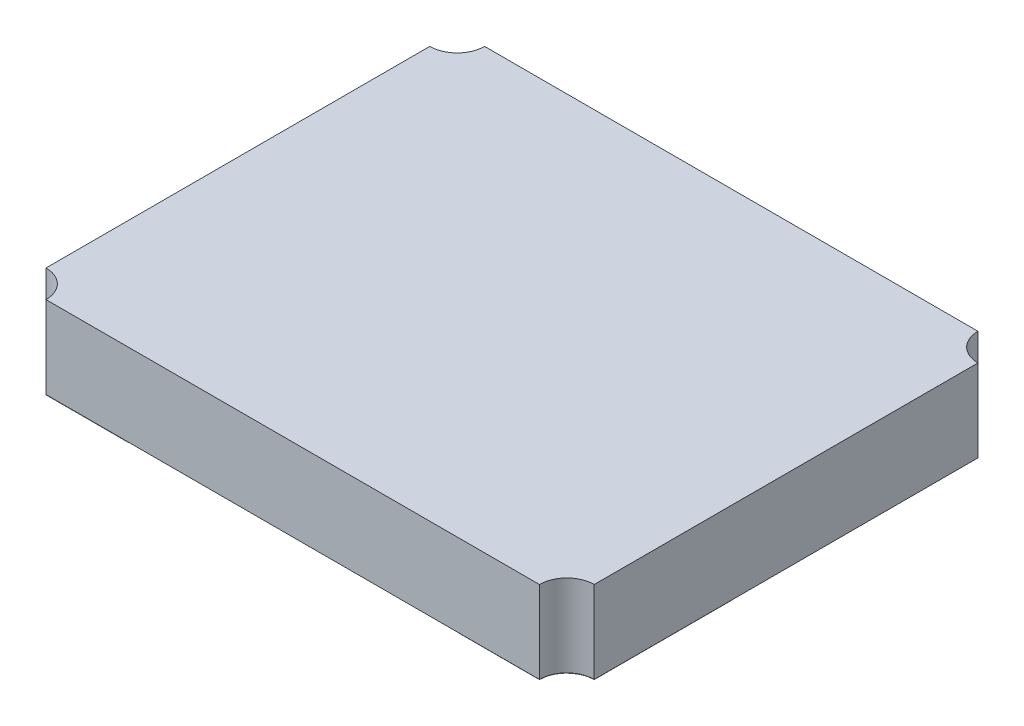
ISO-10303-21;
HEADER;
FILE_DESCRIPTION(('STEP AP214'),'2;1');
FILE_NAME('part.step','',(''),(''),'','','');
FILE_SCHEMA(('AUTOMOTIVE_DESIGN { 1 0 10303 214 1 1 1 1 }'));
ENDSEC;
DATA;
#1=APPLICATION_CONTEXT('core data for automotive mechanical design processes');
#2=APPLICATION_PROTOCOL_DEFINITION('international standard','automotive_design',2000,#1);
#3=PRODUCT_CONTEXT('',#1,'mechanical');
#4=PRODUCT('Part','Part','',(#3));
#5=PRODUCT_RELATED_PRODUCT_CATEGORY('part','',(#4));
#6=PRODUCT_DEFINITION_FORMATION('','',#4);
#7=PRODUCT_DEFINITION_CONTEXT('part definition',#1,'design');
#8=PRODUCT_DEFINITION('design','',#6,#7);
#9=PRODUCT_DEFINITION_SHAPE('','',#8);
#10=(LENGTH_UNIT() NAMED_UNIT(*) SI_UNIT(.MILLI.,.METRE.));
#11=(NAMED_UNIT(*) PLANE_ANGLE_UNIT() SI_UNIT($,.RADIAN.));
#12=(NAMED_UNIT(*) SI_UNIT($,.STERADIAN.) SOLID_ANGLE_UNIT());
#13=UNCERTAINTY_MEASURE_WITH_UNIT(LENGTH_MEASURE(1.E-05),#10,'distance_accuracy_value','');
#14=(GEOMETRIC_REPRESENTATION_CONTEXT(3) GLOBAL_UNCERTAINTY_ASSIGNED_CONTEXT((#13)) GLOBAL_UNIT_ASSIGNED_CONTEXT((#10,
#11,#12)) REPRESENTATION_CONTEXT('',''));
#15=CARTESIAN_POINT('',(0.,0.,0.));
#16=DIRECTION('',(0.,0.,1.));
#17=DIRECTION('',(1.,0.,0.));
#18=AXIS2_PLACEMENT_3D('',#15,#16,#17);
#19=CARTESIAN_POINT('',(0.,0.,0.));
#20=DIRECTION('',(0.,-1.,0.));
#21=DIRECTION('',(0.,0.,-1.));
#22=AXIS2_PLACEMENT_3D('',#19,#20,#21);
#23=PLANE('',#22);
#24=DIRECTION('',(0.,0.,1.));
#25=VECTOR('',#24,1.);
#26=CARTESIAN_POINT('',(-1.,0.,0.7));
#27=LINE('',#26,#25);
#28=CARTESIAN_POINT('',(-1.,0.,-0.7));
#29=VERTEX_POINT('',#28);
#30=CARTESIAN_POINT('',(-1.,0.,0.7));
#31=VERTEX_POINT('',#30);
#32=EDGE_CURVE('P0_E109',#29,#31,#27,.T.);
#33=ORIENTED_EDGE('',*,*,#32,.F.);
#34=CARTESIAN_POINT('',(-1.,0.,-0.8));
#35=DIRECTION('',(0.,-1.,0.));
#36=DIRECTION('',(0.,0.,-1.));
#37=AXIS2_PLACEMENT_3D('',#34,#35,#36);
#38=CIRCLE('',#37,0.1);
#39=CARTESIAN_POINT('',(-0.9,0.,-0.8));
#40=VERTEX_POINT('',#39);
#41=EDGE_CURVE('P0_E88',#29,#40,#38,.F.);
#42=ORIENTED_EDGE('',*,*,#41,.T.);
#43=DIRECTION('',(-1.,0.,0.));
#44=VECTOR('',#43,1.);
#45=CARTESIAN_POINT('',(-0.9,0.,-0.8));
#46=LINE('',#45,#44);
#47=CARTESIAN_POINT('',(0.9,0.,-0.8));
#48=VERTEX_POINT('',#47);
#49=EDGE_CURVE('P0_E86',#48,#40,#46,.T.);
#50=ORIENTED_EDGE('',*,*,#49,.F.);
#51=CARTESIAN_POINT('',(1.,0.,-0.8));
#52=DIRECTION('',(0.,-1.,0.));
#53=DIRECTION('',(0.,0.,-1.));
#54=AXIS2_PLACEMENT_3D('',#51,#52,#53);
#55=CIRCLE('',#54,0.1);
#56=CARTESIAN_POINT('',(1.,0.,-0.7));
#57=VERTEX_POINT('',#56);
#58=EDGE_CURVE('P0_E19',#48,#57,#55,.F.);
#59=ORIENTED_EDGE('',*,*,#58,.T.);
#60=DIRECTION('',(0.,0.,-1.));
#61=VECTOR('',#60,1.);
#62=CARTESIAN_POINT('',(1.,0.,0.));
#63=LINE('',#62,#61);
#64=CARTESIAN_POINT('',(1.,0.,0.7));
#65=VERTEX_POINT('',#64);
#66=EDGE_CURVE('P0_E84',#57,#65,#63,.F.);
#67=ORIENTED_EDGE('',*,*,#66,.T.);
#68=CARTESIAN_POINT('',(1.,0.,0.8));
#69=DIRECTION('',(0.,-1.,0.));
#70=DIRECTION('',(0.,0.,-1.));
#71=AXIS2_PLACEMENT_3D('',#68,#69,#70);
#72=CIRCLE('',#71,0.1);
#73=CARTESIAN_POINT('',(0.9,0.,0.8));
#74=VERTEX_POINT('',#73);
#75=EDGE_CURVE('P0_E118',#65,#74,#72,.F.);
#76=ORIENTED_EDGE('',*,*,#75,.T.);
#77=DIRECTION('',(1.,0.,0.));
#78=VECTOR('',#77,1.);
#79=CARTESIAN_POINT('',(0.9,0.,0.8));
#80=LINE('',#79,#78);
#81=CARTESIAN_POINT('',(-0.9,0.,0.8));
#82=VERTEX_POINT('',#81);
#83=EDGE_CURVE('P0_E115',#82,#74,#80,.T.);
#84=ORIENTED_EDGE('',*,*,#83,.F.);
#85=CARTESIAN_POINT('',(-1.,0.,0.8));
#86=DIRECTION('',(0.,-1.,0.));
#87=DIRECTION('',(0.,0.,-1.));
#88=AXIS2_PLACEMENT_3D('',#85,#86,#87);
#89=CIRCLE('',#88,0.1);
#90=EDGE_CURVE('P0_E113',#82,#31,#89,.F.);
#91=ORIENTED_EDGE('',*,*,#90,.T.);
#92=EDGE_LOOP('',(#33,#42,#50,#59,#67,#76,#84,#91));
#93=FACE_BOUND('',#92,.T.);
#94=ADVANCED_FACE('P0_F16',(#93),#23,.T.);
#95=CARTESIAN_POINT('',(1.,0.3,0.8));
#96=DIRECTION('',(0.,-1.,0.));
#97=DIRECTION('',(0.,0.,-1.));
#98=AXIS2_PLACEMENT_3D('',#95,#96,#97);
#99=CYLINDRICAL_SURFACE('',#98,0.1);
#100=DIRECTION('',(0.,1.,0.));
#101=VECTOR('',#100,1.);
#102=CARTESIAN_POINT('',(1.,0.3,0.7));
#103=LINE('',#102,#101);
#104=CARTESIAN_POINT('',(1.,0.3,0.7));
#105=VERTEX_POINT('',#104);
#106=EDGE_CURVE('P0_E97',#105,#65,#103,.F.);
#107=ORIENTED_EDGE('',*,*,#106,.F.);
#108=CARTESIAN_POINT('',(1.,0.3,0.8));
#109=DIRECTION('',(0.,-1.,0.));
#110=DIRECTION('',(0.,0.,-1.));
#111=AXIS2_PLACEMENT_3D('',#108,#109,#110);
#112=CIRCLE('',#111,0.1);
#113=CARTESIAN_POINT('',(0.9,0.3,0.8));
#114=VERTEX_POINT('',#113);
#115=EDGE_CURVE('P0_E130',#105,#114,#112,.F.);
#116=ORIENTED_EDGE('',*,*,#115,.T.);
#117=DIRECTION('',(0.,1.,0.));
#118=VECTOR('',#117,1.);
#119=CARTESIAN_POINT('',(0.9,0.3,0.8));
#120=LINE('',#119,#118);
#121=EDGE_CURVE('P0_E114',#74,#114,#120,.T.);
#122=ORIENTED_EDGE('',*,*,#121,.F.);
#123=ORIENTED_EDGE('',*,*,#75,.F.);
#124=EDGE_LOOP('',(#107,#116,#122,#123));
#125=FACE_BOUND('',#124,.T.);
#126=ADVANCED_FACE('P0_F141',(#125),#99,.F.);
#127=CARTESIAN_POINT('',(0.9,0.3,0.8));
#128=DIRECTION('',(0.,0.,1.));
#129=DIRECTION('',(1.,0.,0.));
#130=AXIS2_PLACEMENT_3D('',#127,#128,#129);
#131=PLANE('',#130);
#132=ORIENTED_EDGE('',*,*,#83,.T.);
#133=ORIENTED_EDGE('',*,*,#121,.T.);
#134=DIRECTION('',(1.,0.,0.));
#135=VECTOR('',#134,1.);
#136=CARTESIAN_POINT('',(0.,0.3,0.8));
#137=LINE('',#136,#135);
#138=CARTESIAN_POINT('',(-0.9,0.3,0.8));
#139=VERTEX_POINT('',#138);
#140=EDGE_CURVE('P0_E129',#114,#139,#137,.F.);
#141=ORIENTED_EDGE('',*,*,#140,.T.);
#142=DIRECTION('',(0.,-1.,0.));
#143=VECTOR('',#142,1.);
#144=CARTESIAN_POINT('',(-0.9,0.3,0.8));
#145=LINE('',#144,#143);
#146=EDGE_CURVE('P0_E110',#139,#82,#145,.T.);
#147=ORIENTED_EDGE('',*,*,#146,.T.);
#148=EDGE_LOOP('',(#132,#133,#141,#147));
#149=FACE_BOUND('',#148,.T.);
#150=ADVANCED_FACE('P0_F145',(#149),#131,.T.);
#151=CARTESIAN_POINT('',(-1.,0.3,0.8));
#152=DIRECTION('',(0.,-1.,0.));
#153=DIRECTION('',(0.,0.,-1.));
#154=AXIS2_PLACEMENT_3D('',#151,#152,#153);
#155=CYLINDRICAL_SURFACE('',#154,0.1);
#156=ORIENTED_EDGE('',*,*,#146,.F.);
#157=CARTESIAN_POINT('',(-1.,0.3,0.8));
#158=DIRECTION('',(0.,-1.,0.));
#159=DIRECTION('',(0.,0.,-1.));
#160=AXIS2_PLACEMENT_3D('',#157,#158,#159);
#161=CIRCLE('',#160,0.1);
#162=CARTESIAN_POINT('',(-1.,0.3,0.7));
#163=VERTEX_POINT('',#162);
#164=EDGE_CURVE('P0_E126',#139,#163,#161,.F.);
#165=ORIENTED_EDGE('',*,*,#164,.T.);
#166=DIRECTION('',(0.,1.,0.));
#167=VECTOR('',#166,1.);
#168=CARTESIAN_POINT('',(-1.,0.3,0.7));
#169=LINE('',#168,#167);
#170=EDGE_CURVE('P0_E107',#31,#163,#169,.T.);
#171=ORIENTED_EDGE('',*,*,#170,.F.);
#172=ORIENTED_EDGE('',*,*,#90,.F.);
#173=EDGE_LOOP('',(#156,#165,#171,#172));
#174=FACE_BOUND('',#173,.T.);
#175=ADVANCED_FACE('P0_F159',(#174),#155,.F.);
#176=CARTESIAN_POINT('',(-1.,0.3,0.7));
#177=DIRECTION('',(-1.,0.,0.));
#178=DIRECTION('',(0.,0.,1.));
#179=AXIS2_PLACEMENT_3D('',#176,#177,#178);
#180=PLANE('',#179);
#181=ORIENTED_EDGE('',*,*,#32,.T.);
#182=ORIENTED_EDGE('',*,*,#170,.T.);
#183=DIRECTION('',(0.,0.,-1.));
#184=VECTOR('',#183,1.);
#185=CARTESIAN_POINT('',(-1.,0.3,0.));
#186=LINE('',#185,#184);
#187=CARTESIAN_POINT('',(-1.,0.3,-0.7));
#188=VERTEX_POINT('',#187);
#189=EDGE_CURVE('P0_E125',#163,#188,#186,.T.);
#190=ORIENTED_EDGE('',*,*,#189,.T.);
#191=DIRECTION('',(0.,-1.,0.));
#192=VECTOR('',#191,1.);
#193=CARTESIAN_POINT('',(-1.,0.3,-0.7));
#194=LINE('',#193,#192);
#195=EDGE_CURVE('P0_E104',#188,#29,#194,.T.);
#196=ORIENTED_EDGE('',*,*,#195,.T.);
#197=EDGE_LOOP('',(#181,#182,#190,#196));
#198=FACE_BOUND('',#197,.T.);
#199=ADVANCED_FACE('P0_F155',(#198),#180,.T.);
#200=CARTESIAN_POINT('',(-1.,0.3,-0.8));
#201=DIRECTION('',(0.,-1.,0.));
#202=DIRECTION('',(0.,0.,-1.));
#203=AXIS2_PLACEMENT_3D('',#200,#201,#202);
#204=CYLINDRICAL_SURFACE('',#203,0.1);
#205=ORIENTED_EDGE('',*,*,#195,.F.);
#206=CARTESIAN_POINT('',(-1.,0.3,-0.8));
#207=DIRECTION('',(0.,-1.,0.));
#208=DIRECTION('',(0.,0.,-1.));
#209=AXIS2_PLACEMENT_3D('',#206,#207,#208);
#210=CIRCLE('',#209,0.1);
#211=CARTESIAN_POINT('',(-0.9,0.3,-0.8));
#212=VERTEX_POINT('',#211);
#213=EDGE_CURVE('P0_E122',#188,#212,#210,.F.);
#214=ORIENTED_EDGE('',*,*,#213,.T.);
#215=DIRECTION('',(0.,1.,0.));
#216=VECTOR('',#215,1.);
#217=CARTESIAN_POINT('',(-0.9,0.3,-0.8));
#218=LINE('',#217,#216);
#219=EDGE_CURVE('P0_E91',#40,#212,#218,.T.);
#220=ORIENTED_EDGE('',*,*,#219,.F.);
#221=ORIENTED_EDGE('',*,*,#41,.F.);
#222=EDGE_LOOP('',(#205,#214,#220,#221));
#223=FACE_BOUND('',#222,.T.);
#224=ADVANCED_FACE('P0_F161',(#223),#204,.F.);
#225=CARTESIAN_POINT('',(-0.9,0.3,-0.8));
#226=DIRECTION('',(0.,0.,-1.));
#227=DIRECTION('',(-1.,0.,0.));
#228=AXIS2_PLACEMENT_3D('',#225,#226,#227);
#229=PLANE('',#228);
#230=ORIENTED_EDGE('',*,*,#49,.T.);
#231=ORIENTED_EDGE('',*,*,#219,.T.);
#232=DIRECTION('',(1.,0.,0.));
#233=VECTOR('',#232,1.);
#234=CARTESIAN_POINT('',(0.,0.3,-0.8));
#235=LINE('',#234,#233);
#236=CARTESIAN_POINT('',(0.9,0.3,-0.8));
#237=VERTEX_POINT('',#236);
#238=EDGE_CURVE('P0_E96',#212,#237,#235,.T.);
#239=ORIENTED_EDGE('',*,*,#238,.T.);
#240=DIRECTION('',(0.,-1.,0.));
#241=VECTOR('',#240,1.);
#242=CARTESIAN_POINT('',(0.9,0.3,-0.8));
#243=LINE('',#242,#241);
#244=EDGE_CURVE('P0_E81',#237,#48,#243,.T.);
#245=ORIENTED_EDGE('',*,*,#244,.T.);
#246=EDGE_LOOP('',(#230,#231,#239,#245));
#247=FACE_BOUND('',#246,.T.);
#248=ADVANCED_FACE('P0_F94',(#247),#229,.T.);
#249=CARTESIAN_POINT('',(1.,0.3,-0.8));
#250=DIRECTION('',(0.,-1.,0.));
#251=DIRECTION('',(0.,0.,-1.));
#252=AXIS2_PLACEMENT_3D('',#249,#250,#251);
#253=CYLINDRICAL_SURFACE('',#252,0.1);
#254=ORIENTED_EDGE('',*,*,#244,.F.);
#255=CARTESIAN_POINT('',(1.,0.3,-0.8));
#256=DIRECTION('',(0.,-1.,0.));
#257=DIRECTION('',(0.,0.,-1.));
#258=AXIS2_PLACEMENT_3D('',#255,#256,#257);
#259=CIRCLE('',#258,0.1);
#260=CARTESIAN_POINT('',(1.,0.3,-0.7));
#261=VERTEX_POINT('',#260);
#262=EDGE_CURVE('P0_E25',#237,#261,#259,.F.);
#263=ORIENTED_EDGE('',*,*,#262,.T.);
#264=DIRECTION('',(0.,1.,0.));
#265=VECTOR('',#264,1.);
#266=CARTESIAN_POINT('',(1.,0.3,-0.7));
#267=LINE('',#266,#265);
#268=EDGE_CURVE('P0_E33',#57,#261,#267,.T.);
#269=ORIENTED_EDGE('',*,*,#268,.F.);
#270=ORIENTED_EDGE('',*,*,#58,.F.);
#271=EDGE_LOOP('',(#254,#263,#269,#270));
#272=FACE_BOUND('',#271,.T.);
#273=ADVANCED_FACE('P0_F78',(#272),#253,.F.);
#274=CARTESIAN_POINT('',(1.,0.3,-0.7));
#275=DIRECTION('',(1.,0.,0.));
#276=DIRECTION('',(0.,0.,-1.));
#277=AXIS2_PLACEMENT_3D('',#274,#275,#276);
#278=PLANE('',#277);
#279=ORIENTED_EDGE('',*,*,#66,.F.);
#280=ORIENTED_EDGE('',*,*,#268,.T.);
#281=DIRECTION('',(0.,0.,-1.));
#282=VECTOR('',#281,1.);
#283=CARTESIAN_POINT('',(1.,0.3,0.));
#284=LINE('',#283,#282);
#285=EDGE_CURVE('P0_E11',#261,#105,#284,.F.);
#286=ORIENTED_EDGE('',*,*,#285,.T.);
#287=ORIENTED_EDGE('',*,*,#106,.T.);
#288=EDGE_LOOP('',(#279,#280,#286,#287));
#289=FACE_BOUND('',#288,.T.);
#290=ADVANCED_FACE('P0_F162',(#289),#278,.T.);
#291=CARTESIAN_POINT('',(0.,0.3,0.));
#292=DIRECTION('',(0.,-1.,0.));
#293=DIRECTION('',(0.,0.,-1.));
#294=AXIS2_PLACEMENT_3D('',#291,#292,#293);
#295=PLANE('',#294);
#296=ORIENTED_EDGE('',*,*,#262,.F.);
#297=ORIENTED_EDGE('',*,*,#238,.F.);
#298=ORIENTED_EDGE('',*,*,#213,.F.);
#299=ORIENTED_EDGE('',*,*,#189,.F.);
#300=ORIENTED_EDGE('',*,*,#164,.F.);
#301=ORIENTED_EDGE('',*,*,#140,.F.);
#302=ORIENTED_EDGE('',*,*,#115,.F.);
#303=ORIENTED_EDGE('',*,*,#285,.F.);
#304=EDGE_LOOP('',(#296,#297,#298,#299,#300,#301,#302,#303));
#305=FACE_BOUND('',#304,.T.);
#306=ADVANCED_FACE('P0_F148',(#305),#295,.F.);
#307=CLOSED_SHELL('',(#94,#126,#150,#175,#199,#224,#248,#273,#290,#306));
#308=MANIFOLD_SOLID_BREP('P0_B1',#307);
#309=CARTESIAN_POINT('',(-0.799999993294,-0.001,0.499999997765));
#310=DIRECTION('',(0.,-1.,0.));
#311=DIRECTION('',(0.,0.,-1.));
#312=AXIS2_PLACEMENT_3D('',#309,#310,#311);
#313=PLANE('',#312);
#314=CARTESIAN_POINT('',(-0.9,-0.001,0.8));
#315=CARTESIAN_POINT('',(-0.9,-0.001,0.759351867215465));
#316=CARTESIAN_POINT('',(-0.929289321881345,-0.001,0.729289321881346));
#317=CARTESIAN_POINT('',(-0.957825307997445,-0.001,0.7));
#318=CARTESIAN_POINT('',(-1.,-0.001,0.7));
#319=B_SPLINE_CURVE_WITH_KNOTS('',2,(#314,#315,#316,#317,#318),.UNSPECIFIED.,.F.,.F.,(3,2,3),
(0.,0.5,1.),.UNSPECIFIED.);
#320=CARTESIAN_POINT('',(-0.9,-0.001,0.8));
#321=VERTEX_POINT('',#320);
#322=CARTESIAN_POINT('',(-1.,-0.001,0.7));
#323=VERTEX_POINT('',#322);
#324=EDGE_CURVE('P1_E23',#321,#323,#319,.T.);
#325=ORIENTED_EDGE('',*,*,#324,.T.);
#326=DIRECTION('',(0.,0.,-1.));
#327=VECTOR('',#326,1.);
#328=CARTESIAN_POINT('',(-1.,-0.001,0.499999997765));
#329=LINE('',#328,#327);
#330=CARTESIAN_POINT('',(-1.,-0.001,0.19999999553));
#331=VERTEX_POINT('',#330);
#332=EDGE_CURVE('P1_E11',#323,#331,#329,.T.);
#333=ORIENTED_EDGE('',*,*,#332,.T.);
#334=DIRECTION('',(1.,0.,0.));
#335=VECTOR('',#334,1.);
#336=CARTESIAN_POINT('',(-0.799999993294,-0.001,0.19999999553));
#337=LINE('',#336,#335);
#338=CARTESIAN_POINT('',(-0.599999986589,-0.001,0.19999999553));
#339=VERTEX_POINT('',#338);
#340=EDGE_CURVE('P1_E18',#331,#339,#337,.T.);
#341=ORIENTED_EDGE('',*,*,#340,.T.);
#342=DIRECTION('',(0.,0.,-1.));
#343=VECTOR('',#342,1.);
#344=CARTESIAN_POINT('',(-0.599999986589,-0.001,0.499999997765));
#345=LINE('',#344,#343);
#346=CARTESIAN_POINT('',(-0.599999986589,-0.001,0.8));
#347=VERTEX_POINT('',#346);
#348=EDGE_CURVE('P1_E44',#339,#347,#345,.F.);
#349=ORIENTED_EDGE('',*,*,#348,.T.);
#350=DIRECTION('',(1.,0.,0.));
#351=VECTOR('',#350,1.);
#352=CARTESIAN_POINT('',(-0.799999993294,-0.001,0.8));
#353=LINE('',#352,#351);
#354=EDGE_CURVE('P1_E34',#347,#321,#353,.F.);
#355=ORIENTED_EDGE('',*,*,#354,.T.);
#356=EDGE_LOOP('',(#325,#333,#341,#349,#355));
#357=FACE_BOUND('',#356,.T.);
#358=ADVANCED_FACE('P1_F16',(#357),#313,.T.);
#359=OPEN_SHELL('',(#358));
#360=SHELL_BASED_SURFACE_MODEL('P1_B1',(#359));
#361=CARTESIAN_POINT('',(0.799999993294,-0.001,0.499999997765));
#362=DIRECTION('',(0.,-1.,0.));
#363=DIRECTION('',(0.,0.,-1.));
#364=AXIS2_PLACEMENT_3D('',#361,#362,#363);
#365=PLANE('',#364);
#366=CARTESIAN_POINT('',(0.9,-0.001,0.8));
#367=DIRECTION('',(-1.,0.,0.));
#368=VECTOR('',#367,1.);
#369=LINE('',#366,#368);
#370=CARTESIAN_POINT('',(0.9,-0.0005,0.8));
#371=VERTEX_POINT('',#370);
#372=CARTESIAN_POINT('',(0.599999986589,-0.0005,0.8));
#373=VERTEX_POINT('',#372);
#374=EDGE_CURVE('P2_E46',#371,#373,#369,.T.);
#375=ORIENTED_EDGE('',*,*,#374,.T.);
#376=CARTESIAN_POINT('',(0.599999986589,-0.001,0.8));
#377=DIRECTION('',(0.,0.,-1.));
#378=VECTOR('',#377,1.);
#379=LINE('',#376,#378);
#380=CARTESIAN_POINT('',(0.599999986589,-0.0005,0.19999999553));
#381=VERTEX_POINT('',#380);
#382=EDGE_CURVE('P2_E43',#373,#381,#379,.T.);
#383=ORIENTED_EDGE('',*,*,#382,.T.);
#384=CARTESIAN_POINT('',(0.599999986589,-0.001,0.19999999553));
#385=DIRECTION('',(1.,0.,0.));
#386=VECTOR('',#385,1.);
#387=LINE('',#384,#386);
#388=CARTESIAN_POINT('',(0.999999977648,-0.0005,0.19999999553));
#389=VERTEX_POINT('',#388);
#390=EDGE_CURVE('P2_E104',#381,#389,#387,.T.);
#391=ORIENTED_EDGE('',*,*,#390,.T.);
#392=CARTESIAN_POINT('',(0.999999977648,-0.001,0.19999999553));
#393=DIRECTION('',(0.,0.,1.));
#394=VECTOR('',#393,1.);
#395=LINE('',#392,#394);
#396=CARTESIAN_POINT('',(0.999999982304557,-0.0005,0.7));
#397=VERTEX_POINT('',#396);
#398=EDGE_CURVE('P2_E27',#389,#397,#395,.T.);
#399=ORIENTED_EDGE('',*,*,#398,.T.);
#400=CARTESIAN_POINT('',(0.999999986961113,-0.001,0.7));
#401=CARTESIAN_POINT('',(0.959351857945959,-0.001,0.700000005300111));
#402=CARTESIAN_POINT('',(0.929289317271363,-0.001,0.729289326491328));
#403=CARTESIAN_POINT('',(0.9,-0.001,0.757825311866552));
#404=CARTESIAN_POINT('',(0.9,-0.001,0.8));
#405=B_SPLINE_CURVE_WITH_KNOTS('',2,(#400,#401,#402,#403,#404),.UNSPECIFIED.,.F.,.F.,(3,2,3),
(0.,0.5,1.),.UNSPECIFIED.);
#406=EDGE_CURVE('P2_E11',#397,#371,#405,.T.);
#407=ORIENTED_EDGE('',*,*,#406,.T.);
#408=EDGE_LOOP('',(#375,#383,#391,#399,#407));
#409=FACE_BOUND('',#408,.T.);
#410=ADVANCED_FACE('P2_F16',(#409),#365,.T.);
#411=CARTESIAN_POINT('',(0.799999993294,0.,0.499999997765));
#412=DIRECTION('',(0.,-1.,0.));
#413=DIRECTION('',(0.,0.,-1.));
#414=AXIS2_PLACEMENT_3D('',#411,#412,#413);
#415=PLANE('',#414);
#416=ORIENTED_EDGE('',*,*,#398,.F.);
#417=ORIENTED_EDGE('',*,*,#390,.F.);
#418=ORIENTED_EDGE('',*,*,#382,.F.);
#419=ORIENTED_EDGE('',*,*,#374,.F.);
#420=ORIENTED_EDGE('',*,*,#406,.F.);
#421=EDGE_LOOP('',(#416,#417,#418,#419,#420));
#422=FACE_BOUND('',#421,.T.);
#423=ADVANCED_FACE('P2_F48',(#422),#415,.F.);
#424=CLOSED_SHELL('',(#410,#423));
#425=MANIFOLD_SOLID_BREP('P2_B1',#424);
#426=CARTESIAN_POINT('',(0.799999993294,0.,-0.499999997765));
#427=DIRECTION('',(0.,-1.,0.));
#428=DIRECTION('',(0.,0.,-1.));
#429=AXIS2_PLACEMENT_3D('',#426,#427,#428);
#430=PLANE('',#429);
#431=DIRECTION('',(1.,0.,0.));
#432=VECTOR('',#431,1.);
#433=CARTESIAN_POINT('',(0.799999993294,0.,-0.8));
#434=LINE('',#433,#432);
#435=CARTESIAN_POINT('',(0.599999986589,0.,-0.8));
#436=VERTEX_POINT('',#435);
#437=CARTESIAN_POINT('',(0.9,0.,-0.8));
#438=VERTEX_POINT('',#437);
#439=EDGE_CURVE('P3_E24',#436,#438,#434,.T.);
#440=ORIENTED_EDGE('',*,*,#439,.T.);
#441=CARTESIAN_POINT('',(0.9,0.,-0.8));
#442=CARTESIAN_POINT('',(0.9,0.,-0.75935186721547));
#443=CARTESIAN_POINT('',(0.929289321881345,0.,-0.729289321881346));
#444=CARTESIAN_POINT('',(0.95782530799744,0.,-0.7));
#445=CARTESIAN_POINT('',(1.,0.,-0.7));
#446=B_SPLINE_CURVE_WITH_KNOTS('',2,(#441,#442,#443,#444,#445),.UNSPECIFIED.,.F.,.F.,(3,2,3),
(0.,0.5,1.),.UNSPECIFIED.);
#447=CARTESIAN_POINT('',(1.,0.,-0.7));
#448=VERTEX_POINT('',#447);
#449=EDGE_CURVE('P3_E11',#438,#448,#446,.T.);
#450=ORIENTED_EDGE('',*,*,#449,.T.);
#451=DIRECTION('',(0.,0.,-1.));
#452=VECTOR('',#451,1.);
#453=CARTESIAN_POINT('',(1.,0.,-0.499999997765));
#454=LINE('',#453,#452);
#455=CARTESIAN_POINT('',(1.,0.,-0.19999999553));
#456=VERTEX_POINT('',#455);
#457=EDGE_CURVE('P3_E18',#448,#456,#454,.F.);
#458=ORIENTED_EDGE('',*,*,#457,.T.);
#459=DIRECTION('',(1.,0.,0.));
#460=VECTOR('',#459,1.);
#461=CARTESIAN_POINT('',(0.799999993294,0.,-0.19999999553));
#462=LINE('',#461,#460);
#463=CARTESIAN_POINT('',(0.599999986589,0.,-0.19999999553));
#464=VERTEX_POINT('',#463);
#465=EDGE_CURVE('P3_E40',#456,#464,#462,.F.);
#466=ORIENTED_EDGE('',*,*,#465,.T.);
#467=DIRECTION('',(0.,0.,-1.));
#468=VECTOR('',#467,1.);
#469=CARTESIAN_POINT('',(0.599999986589,0.,-0.499999997765));
#470=LINE('',#469,#468);
#471=EDGE_CURVE('P3_E42',#464,#436,#470,.T.);
#472=ORIENTED_EDGE('',*,*,#471,.T.);
#473=EDGE_LOOP('',(#440,#450,#458,#466,#472));
#474=FACE_BOUND('',#473,.T.);
#475=ADVANCED_FACE('P3_F16',(#474),#430,.T.);
#476=OPEN_SHELL('',(#475));
#477=SHELL_BASED_SURFACE_MODEL('P3_B1',(#476));
#478=CARTESIAN_POINT('',(0.799999993294,0.,-0.499999997765));
#479=DIRECTION('',(0.,-1.,0.));
#480=DIRECTION('',(0.,0.,-1.));
#481=AXIS2_PLACEMENT_3D('',#478,#479,#480);
#482=PLANE('',#481);
#483=DIRECTION('',(0.,0.,-1.));
#484=VECTOR('',#483,1.);
#485=CARTESIAN_POINT('',(0.599999986589,0.,-0.499999997765));
#486=LINE('',#485,#484);
#487=CARTESIAN_POINT('',(0.599999986589,0.,-0.19999999553));
#488=VERTEX_POINT('',#487);
#489=CARTESIAN_POINT('',(0.599999986589,0.,-0.8));
#490=VERTEX_POINT('',#489);
#491=EDGE_CURVE('P4_E24',#488,#490,#486,.T.);
#492=ORIENTED_EDGE('',*,*,#491,.T.);
#493=DIRECTION('',(1.,0.,0.));
#494=VECTOR('',#493,1.);
#495=CARTESIAN_POINT('',(0.799999993294,0.,-0.8));
#496=LINE('',#495,#494);
#497=CARTESIAN_POINT('',(0.9,0.,-0.8));
#498=VERTEX_POINT('',#497);
#499=EDGE_CURVE('P4_E11',#490,#498,#496,.T.);
#500=ORIENTED_EDGE('',*,*,#499,.T.);
#501=CARTESIAN_POINT('',(0.9,0.,-0.8));
#502=CARTESIAN_POINT('',(0.9,0.,-0.75935186721547));
#503=CARTESIAN_POINT('',(0.929289321881345,0.,-0.729289321881346));
#504=CARTESIAN_POINT('',(0.95782530799744,0.,-0.7));
#505=CARTESIAN_POINT('',(1.,0.,-0.7));
#506=B_SPLINE_CURVE_WITH_KNOTS('',2,(#501,#502,#503,#504,#505),.UNSPECIFIED.,.F.,.F.,(3,2,3),
(0.,0.5,1.),.UNSPECIFIED.);
#507=CARTESIAN_POINT('',(1.,0.,-0.7));
#508=VERTEX_POINT('',#507);
#509=EDGE_CURVE('P4_E40',#498,#508,#506,.T.);
#510=ORIENTED_EDGE('',*,*,#509,.T.);
#511=DIRECTION('',(0.,0.,-1.));
#512=VECTOR('',#511,1.);
#513=CARTESIAN_POINT('',(1.,0.,-0.499999997765));
#514=LINE('',#513,#512);
#515=CARTESIAN_POINT('',(1.,0.,-0.19999999553));
#516=VERTEX_POINT('',#515);
#517=EDGE_CURVE('P4_E18',#508,#516,#514,.F.);
#518=ORIENTED_EDGE('',*,*,#517,.T.);
#519=DIRECTION('',(1.,0.,0.));
#520=VECTOR('',#519,1.);
#521=CARTESIAN_POINT('',(0.799999993294,0.,-0.19999999553));
#522=LINE('',#521,#520);
#523=EDGE_CURVE('P4_E46',#516,#488,#522,.F.);
#524=ORIENTED_EDGE('',*,*,#523,.T.);
#525=EDGE_LOOP('',(#492,#500,#510,#518,#524));
#526=FACE_BOUND('',#525,.T.);
#527=ADVANCED_FACE('P4_F16',(#526),#482,.T.);
#528=OPEN_SHELL('',(#527));
#529=SHELL_BASED_SURFACE_MODEL('P4_B1',(#528));
#530=CARTESIAN_POINT('',(-0.799999993294,-0.001,-0.5));
#531=DIRECTION('',(0.,-1.,0.));
#532=DIRECTION('',(0.,0.,-1.));
#533=AXIS2_PLACEMENT_3D('',#530,#531,#532);
#534=PLANE('',#533);
#535=CARTESIAN_POINT('',(-1.,-0.001,-0.7));
#536=CARTESIAN_POINT('',(-0.959351867215471,-0.001,-0.7));
#537=CARTESIAN_POINT('',(-0.929289321881345,-0.001,-0.729289321881346));
#538=CARTESIAN_POINT('',(-0.9,-0.001,-0.75782530799744));
#539=CARTESIAN_POINT('',(-0.9,-0.001,-0.8));
#540=B_SPLINE_CURVE_WITH_KNOTS('',2,(#535,#536,#537,#538,#539),.UNSPECIFIED.,.F.,.F.,(3,2,3),
(0.,0.5,1.),.UNSPECIFIED.);
#541=CARTESIAN_POINT('',(-1.,-0.001,-0.7));
#542=VERTEX_POINT('',#541);
#543=CARTESIAN_POINT('',(-0.9,-0.001,-0.8));
#544=VERTEX_POINT('',#543);
#545=EDGE_CURVE('P5_E23',#542,#544,#540,.T.);
#546=ORIENTED_EDGE('',*,*,#545,.T.);
#547=DIRECTION('',(1.,0.,0.));
#548=VECTOR('',#547,1.);
#549=CARTESIAN_POINT('',(-0.799999993294,-0.001,-0.8));
#550=LINE('',#549,#548);
#551=CARTESIAN_POINT('',(-0.599999986589,-0.001,-0.8));
#552=VERTEX_POINT('',#551);
#553=EDGE_CURVE('P5_E11',#544,#552,#550,.T.);
#554=ORIENTED_EDGE('',*,*,#553,.T.);
#555=DIRECTION('',(0.,0.,-1.));
#556=VECTOR('',#555,1.);
#557=CARTESIAN_POINT('',(-0.599999986589,-0.001,-0.5));
#558=LINE('',#557,#556);
#559=CARTESIAN_POINT('',(-0.599999986589,-0.001,-0.2));
#560=VERTEX_POINT('',#559);
#561=EDGE_CURVE('P5_E18',#552,#560,#558,.F.);
#562=ORIENTED_EDGE('',*,*,#561,.T.);
#563=DIRECTION('',(1.,0.,0.));
#564=VECTOR('',#563,1.);
#565=CARTESIAN_POINT('',(-0.799999993294,-0.001,-0.2));
#566=LINE('',#565,#564);
#567=CARTESIAN_POINT('',(-1.,-0.001,-0.2));
#568=VERTEX_POINT('',#567);
#569=EDGE_CURVE('P5_E44',#560,#568,#566,.F.);
#570=ORIENTED_EDGE('',*,*,#569,.T.);
#571=DIRECTION('',(0.,0.,-1.));
#572=VECTOR('',#571,1.);
#573=CARTESIAN_POINT('',(-1.,-0.001,-0.5));
#574=LINE('',#573,#572);
#575=EDGE_CURVE('P5_E34',#568,#542,#574,.T.);
#576=ORIENTED_EDGE('',*,*,#575,.T.);
#577=EDGE_LOOP('',(#546,#554,#562,#570,#576));
#578=FACE_BOUND('',#577,.T.);
#579=ADVANCED_FACE('P5_F16',(#578),#534,.T.);
#580=OPEN_SHELL('',(#579));
#581=SHELL_BASED_SURFACE_MODEL('P5_B1',(#580));
#582=ADVANCED_BREP_SHAPE_REPRESENTATION('',(#18,#308,#425),#14);
#583=MANIFOLD_SURFACE_SHAPE_REPRESENTATION('',(#18,#360,#477,#529,#581),#14);
#584=SHAPE_REPRESENTATION('',(#18),#14);
#585=SHAPE_DEFINITION_REPRESENTATION(#9,#584);
#586=SHAPE_REPRESENTATION_RELATIONSHIP('','',#584,#582);
#587=SHAPE_REPRESENTATION_RELATIONSHIP('','',#584,#583);
ENDSEC;
END-ISO-10303-21;
